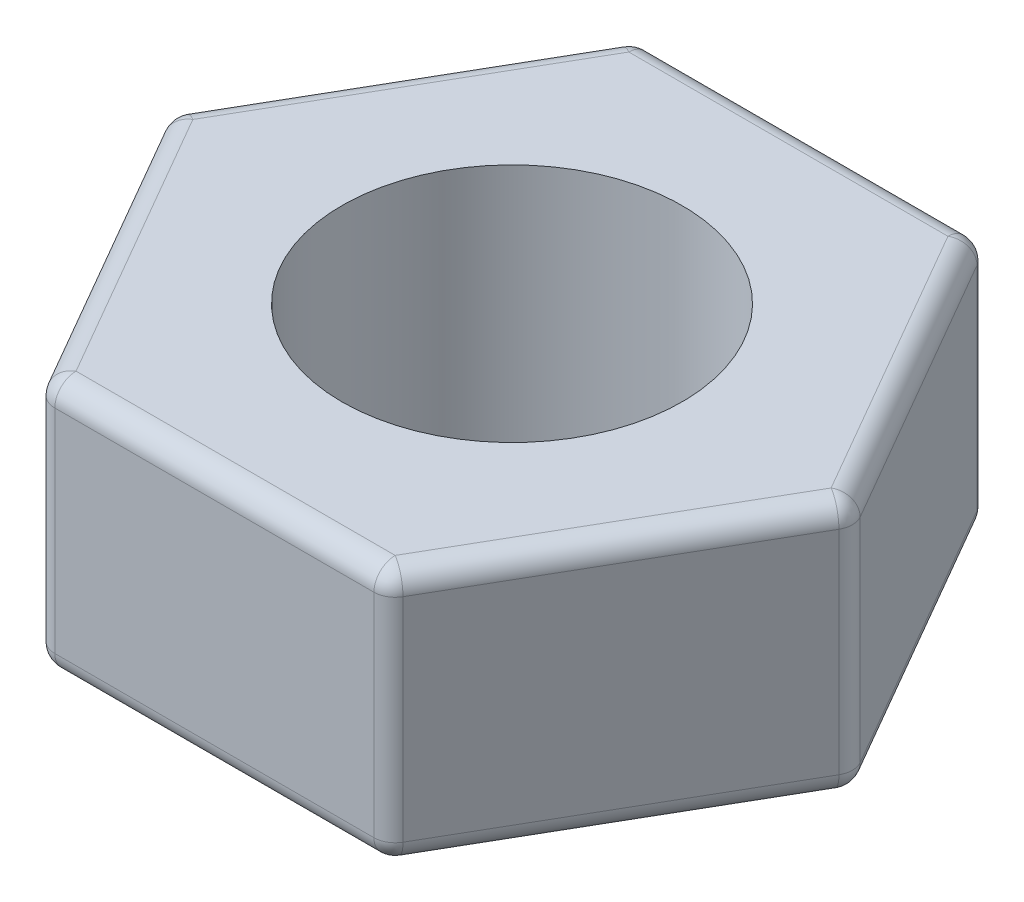
ISO-10303-21;
HEADER;
FILE_DESCRIPTION(('STEP AP214'),'2;1');
FILE_NAME('part.step','',(''),(''),'','','');
FILE_SCHEMA(('AUTOMOTIVE_DESIGN { 1 0 10303 214 1 1 1 1 }'));
ENDSEC;
DATA;
#1=APPLICATION_CONTEXT('core data for automotive mechanical design processes');
#2=APPLICATION_PROTOCOL_DEFINITION('international standard','automotive_design',2000,#1);
#3=PRODUCT_CONTEXT('',#1,'mechanical');
#4=PRODUCT('Part','Part','',(#3));
#5=PRODUCT_RELATED_PRODUCT_CATEGORY('part','',(#4));
#6=PRODUCT_DEFINITION_FORMATION('','',#4);
#7=PRODUCT_DEFINITION_CONTEXT('part definition',#1,'design');
#8=PRODUCT_DEFINITION('design','',#6,#7);
#9=PRODUCT_DEFINITION_SHAPE('','',#8);
#10=(LENGTH_UNIT() NAMED_UNIT(*) SI_UNIT(.MILLI.,.METRE.));
#11=(NAMED_UNIT(*) PLANE_ANGLE_UNIT() SI_UNIT($,.RADIAN.));
#12=(NAMED_UNIT(*) SI_UNIT($,.STERADIAN.) SOLID_ANGLE_UNIT());
#13=UNCERTAINTY_MEASURE_WITH_UNIT(LENGTH_MEASURE(1.E-05),#10,'distance_accuracy_value','');
#14=(GEOMETRIC_REPRESENTATION_CONTEXT(3) GLOBAL_UNCERTAINTY_ASSIGNED_CONTEXT((#13)) GLOBAL_UNIT_ASSIGNED_CONTEXT((#10,
#11,#12)) REPRESENTATION_CONTEXT('',''));
#15=CARTESIAN_POINT('',(0.,0.,0.));
#16=DIRECTION('',(0.,0.,1.));
#17=DIRECTION('',(1.,0.,0.));
#18=AXIS2_PLACEMENT_3D('',#15,#16,#17);
#19=CARTESIAN_POINT('',(0.,3.,0.));
#20=DIRECTION('',(0.,1.,0.));
#21=DIRECTION('',(0.,0.,1.));
#22=AXIS2_PLACEMENT_3D('',#19,#20,#21);
#23=PLANE('',#22);
#24=DIRECTION('',(-0.5,0.,-0.866025403784439));
#25=VECTOR('',#24,1.);
#26=CARTESIAN_POINT('',(1.80421959121758,3.,-3.375));
#27=LINE('',#26,#25);
#28=CARTESIAN_POINT('',(3.75277674973257,3.,0.));
#29=VERTEX_POINT('',#28);
#30=CARTESIAN_POINT('',(1.87638837486629,3.,-3.25));
#31=VERTEX_POINT('',#30);
#32=EDGE_CURVE('E388',#29,#31,#27,.T.);
#33=ORIENTED_EDGE('',*,*,#32,.T.);
#34=DIRECTION('',(-1.,0.,0.));
#35=VECTOR('',#34,1.);
#36=CARTESIAN_POINT('',(-2.02072594216369,3.,-3.25));
#37=LINE('',#36,#35);
#38=CARTESIAN_POINT('',(-1.87638837486628,3.,-3.25));
#39=VERTEX_POINT('',#38);
#40=EDGE_CURVE('E391',#31,#39,#37,.T.);
#41=ORIENTED_EDGE('',*,*,#40,.T.);
#42=DIRECTION('',(-0.5,0.,0.866025403784439));
#43=VECTOR('',#42,1.);
#44=CARTESIAN_POINT('',(-3.82494553338127,3.,0.125));
#45=LINE('',#44,#43);
#46=CARTESIAN_POINT('',(-3.75277674973257,3.,0.));
#47=VERTEX_POINT('',#46);
#48=EDGE_CURVE('E385',#39,#47,#45,.T.);
#49=ORIENTED_EDGE('',*,*,#48,.T.);
#50=DIRECTION('',(0.5,0.,0.866025403784439));
#51=VECTOR('',#50,1.);
#52=CARTESIAN_POINT('',(-1.80421959121758,3.,3.375));
#53=LINE('',#52,#51);
#54=CARTESIAN_POINT('',(-1.87638837486629,3.,3.25));
#55=VERTEX_POINT('',#54);
#56=EDGE_CURVE('E379',#47,#55,#53,.T.);
#57=ORIENTED_EDGE('',*,*,#56,.T.);
#58=DIRECTION('',(1.,0.,0.));
#59=VECTOR('',#58,1.);
#60=CARTESIAN_POINT('',(2.02072594216369,3.,3.25));
#61=LINE('',#60,#59);
#62=CARTESIAN_POINT('',(1.87638837486628,3.,3.25));
#63=VERTEX_POINT('',#62);
#64=EDGE_CURVE('E376',#55,#63,#61,.T.);
#65=ORIENTED_EDGE('',*,*,#64,.T.);
#66=DIRECTION('',(0.5,0.,-0.866025403784439));
#67=VECTOR('',#66,1.);
#68=CARTESIAN_POINT('',(3.82494553338127,3.,-0.125000000000001));
#69=LINE('',#68,#67);
#70=EDGE_CURVE('E382',#63,#29,#69,.T.);
#71=ORIENTED_EDGE('',*,*,#70,.T.);
#72=EDGE_LOOP('',(#33,#41,#49,#57,#65,#71));
#73=FACE_BOUND('',#72,.T.);
#74=CARTESIAN_POINT('',(0.,3.,0.));
#75=DIRECTION('',(0.,1.,0.));
#76=DIRECTION('',(0.,0.,1.));
#77=AXIS2_PLACEMENT_3D('',#74,#75,#76);
#78=CIRCLE('',#77,2.);
#79=CARTESIAN_POINT('',(0.,3.,2.));
#80=VERTEX_POINT('',#79);
#81=EDGE_CURVE('E195',#80,#80,#78,.T.);
#82=ORIENTED_EDGE('',*,*,#81,.F.);
#83=EDGE_LOOP('',(#82));
#84=FACE_BOUND('',#83,.T.);
#85=ADVANCED_FACE('F43',(#73,#84),#23,.T.);
#86=CARTESIAN_POINT('',(0.,0.,0.));
#87=DIRECTION('',(0.,1.,0.));
#88=DIRECTION('',(0.,0.,1.));
#89=AXIS2_PLACEMENT_3D('',#86,#87,#88);
#90=PLANE('',#89);
#91=DIRECTION('',(-0.5,0.,0.866025403784439));
#92=VECTOR('',#91,1.);
#93=CARTESIAN_POINT('',(-2.81458256229943,0.,-1.625));
#94=LINE('',#93,#92);
#95=CARTESIAN_POINT('',(-3.75277674973257,0.,0.));
#96=VERTEX_POINT('',#95);
#97=CARTESIAN_POINT('',(-1.87638837486628,0.,-3.25));
#98=VERTEX_POINT('',#97);
#99=EDGE_CURVE('E341',#96,#98,#94,.F.);
#100=ORIENTED_EDGE('',*,*,#99,.T.);
#101=DIRECTION('',(-1.,0.,0.));
#102=VECTOR('',#101,1.);
#103=CARTESIAN_POINT('',(0.,0.,-3.25));
#104=LINE('',#103,#102);
#105=CARTESIAN_POINT('',(1.87638837486629,0.,-3.25));
#106=VERTEX_POINT('',#105);
#107=EDGE_CURVE('E347',#98,#106,#104,.F.);
#108=ORIENTED_EDGE('',*,*,#107,.T.);
#109=DIRECTION('',(-0.5,0.,-0.866025403784439));
#110=VECTOR('',#109,1.);
#111=CARTESIAN_POINT('',(2.81458256229943,0.,-1.625));
#112=LINE('',#111,#110);
#113=CARTESIAN_POINT('',(3.75277674973257,0.,0.));
#114=VERTEX_POINT('',#113);
#115=EDGE_CURVE('E344',#106,#114,#112,.F.);
#116=ORIENTED_EDGE('',*,*,#115,.T.);
#117=DIRECTION('',(0.5,0.,-0.866025403784439));
#118=VECTOR('',#117,1.);
#119=CARTESIAN_POINT('',(2.81458256229943,0.,1.625));
#120=LINE('',#119,#118);
#121=CARTESIAN_POINT('',(1.87638837486628,0.,3.25));
#122=VERTEX_POINT('',#121);
#123=EDGE_CURVE('E338',#114,#122,#120,.F.);
#124=ORIENTED_EDGE('',*,*,#123,.T.);
#125=DIRECTION('',(1.,0.,0.));
#126=VECTOR('',#125,1.);
#127=CARTESIAN_POINT('',(0.,0.,3.25));
#128=LINE('',#127,#126);
#129=CARTESIAN_POINT('',(-1.87638837486629,0.,3.25));
#130=VERTEX_POINT('',#129);
#131=EDGE_CURVE('E335',#122,#130,#128,.F.);
#132=ORIENTED_EDGE('',*,*,#131,.T.);
#133=DIRECTION('',(0.5,0.,0.866025403784439));
#134=VECTOR('',#133,1.);
#135=CARTESIAN_POINT('',(-2.81458256229943,0.,1.625));
#136=LINE('',#135,#134);
#137=EDGE_CURVE('E332',#130,#96,#136,.F.);
#138=ORIENTED_EDGE('',*,*,#137,.T.);
#139=EDGE_LOOP('',(#100,#108,#116,#124,#132,#138));
#140=FACE_BOUND('',#139,.T.);
#141=CARTESIAN_POINT('',(0.,0.,0.));
#142=DIRECTION('',(0.,1.,0.));
#143=DIRECTION('',(0.,0.,1.));
#144=AXIS2_PLACEMENT_3D('',#141,#142,#143);
#145=CIRCLE('',#144,2.);
#146=CARTESIAN_POINT('',(0.,0.,2.));
#147=VERTEX_POINT('',#146);
#148=EDGE_CURVE('E314',#147,#147,#145,.T.);
#149=ORIENTED_EDGE('',*,*,#148,.T.);
#150=EDGE_LOOP('',(#149));
#151=FACE_BOUND('',#150,.T.);
#152=ADVANCED_FACE('F461',(#140,#151),#90,.F.);
#153=CARTESIAN_POINT('',(2.02072594216369,3.,-3.5));
#154=DIRECTION('',(0.,0.,1.));
#155=DIRECTION('',(1.,0.,0.));
#156=AXIS2_PLACEMENT_3D('',#153,#154,#155);
#157=PLANE('',#156);
#158=DIRECTION('',(0.,-1.,0.));
#159=VECTOR('',#158,1.);
#160=CARTESIAN_POINT('',(1.87638837486629,3.,-3.5));
#161=LINE('',#160,#159);
#162=CARTESIAN_POINT('',(1.87638837486629,2.75,-3.5));
#163=VERTEX_POINT('',#162);
#164=CARTESIAN_POINT('',(1.87638837486629,0.25,-3.5));
#165=VERTEX_POINT('',#164);
#166=EDGE_CURVE('E182',#163,#165,#161,.T.);
#167=ORIENTED_EDGE('',*,*,#166,.T.);
#168=DIRECTION('',(-1.,0.,0.));
#169=VECTOR('',#168,1.);
#170=CARTESIAN_POINT('',(2.02072594216369,0.25,-3.5));
#171=LINE('',#170,#169);
#172=CARTESIAN_POINT('',(-1.87638837486628,0.25,-3.5));
#173=VERTEX_POINT('',#172);
#174=EDGE_CURVE('E177',#165,#173,#171,.T.);
#175=ORIENTED_EDGE('',*,*,#174,.T.);
#176=DIRECTION('',(0.,-1.,0.));
#177=VECTOR('',#176,1.);
#178=CARTESIAN_POINT('',(-1.87638837486628,3.,-3.5));
#179=LINE('',#178,#177);
#180=CARTESIAN_POINT('',(-1.87638837486628,2.75,-3.5));
#181=VERTEX_POINT('',#180);
#182=EDGE_CURVE('E171',#173,#181,#179,.F.);
#183=ORIENTED_EDGE('',*,*,#182,.T.);
#184=DIRECTION('',(-1.,0.,0.));
#185=VECTOR('',#184,1.);
#186=CARTESIAN_POINT('',(2.02072594216369,2.75,-3.5));
#187=LINE('',#186,#185);
#188=EDGE_CURVE('E174',#181,#163,#187,.F.);
#189=ORIENTED_EDGE('',*,*,#188,.T.);
#190=EDGE_LOOP('',(#167,#175,#183,#189));
#191=FACE_BOUND('',#190,.T.);
#192=ADVANCED_FACE('F173',(#191),#157,.F.);
#193=CARTESIAN_POINT('',(-2.02072594216369,3.,-3.5));
#194=DIRECTION('',(0.866025403784439,0.,0.5));
#195=DIRECTION('',(0.5,0.,-0.866025403784439));
#196=AXIS2_PLACEMENT_3D('',#193,#194,#195);
#197=PLANE('',#196);
#198=DIRECTION('',(0.,-1.,0.));
#199=VECTOR('',#198,1.);
#200=CARTESIAN_POINT('',(-2.09289472581239,3.,-3.375));
#201=LINE('',#200,#199);
#202=CARTESIAN_POINT('',(-2.09289472581239,2.75,-3.375));
#203=VERTEX_POINT('',#202);
#204=CARTESIAN_POINT('',(-2.09289472581239,0.25,-3.375));
#205=VERTEX_POINT('',#204);
#206=EDGE_CURVE('E207',#203,#205,#201,.T.);
#207=ORIENTED_EDGE('',*,*,#206,.T.);
#208=DIRECTION('',(-0.5,0.,0.866025403784439));
#209=VECTOR('',#208,1.);
#210=CARTESIAN_POINT('',(-2.02072594216369,0.25,-3.5));
#211=LINE('',#210,#209);
#212=CARTESIAN_POINT('',(-3.96928310067868,0.25,-0.125000000000001));
#213=VERTEX_POINT('',#212);
#214=EDGE_CURVE('E372',#205,#213,#211,.T.);
#215=ORIENTED_EDGE('',*,*,#214,.T.);
#216=DIRECTION('',(0.,-1.,0.));
#217=VECTOR('',#216,1.);
#218=CARTESIAN_POINT('',(-3.96928310067868,3.,-0.125000000000001));
#219=LINE('',#218,#217);
#220=CARTESIAN_POINT('',(-3.96928310067868,2.75,-0.125000000000001));
#221=VERTEX_POINT('',#220);
#222=EDGE_CURVE('E367',#213,#221,#219,.F.);
#223=ORIENTED_EDGE('',*,*,#222,.T.);
#224=DIRECTION('',(-0.5,0.,0.866025403784439));
#225=VECTOR('',#224,1.);
#226=CARTESIAN_POINT('',(-2.02072594216369,2.75,-3.5));
#227=LINE('',#226,#225);
#228=EDGE_CURVE('E364',#221,#203,#227,.F.);
#229=ORIENTED_EDGE('',*,*,#228,.T.);
#230=EDGE_LOOP('',(#207,#215,#223,#229));
#231=FACE_BOUND('',#230,.T.);
#232=ADVANCED_FACE('F474',(#231),#197,.F.);
#233=CARTESIAN_POINT('',(-4.04145188432738,3.,0.));
#234=DIRECTION('',(0.866025403784439,0.,-0.5));
#235=DIRECTION('',(-0.5,0.,-0.866025403784439));
#236=AXIS2_PLACEMENT_3D('',#233,#234,#235);
#237=PLANE('',#236);
#238=DIRECTION('',(0.,-1.,0.));
#239=VECTOR('',#238,1.);
#240=CARTESIAN_POINT('',(-3.96928310067868,3.,0.124999999999999));
#241=LINE('',#240,#239);
#242=CARTESIAN_POINT('',(-3.96928310067868,2.75,0.124999999999999));
#243=VERTEX_POINT('',#242);
#244=CARTESIAN_POINT('',(-3.96928310067868,0.25,0.124999999999999));
#245=VERTEX_POINT('',#244);
#246=EDGE_CURVE('E53',#243,#245,#241,.T.);
#247=ORIENTED_EDGE('',*,*,#246,.T.);
#248=DIRECTION('',(0.5,0.,0.866025403784439));
#249=VECTOR('',#248,1.);
#250=CARTESIAN_POINT('',(-4.04145188432738,0.25,0.));
#251=LINE('',#250,#249);
#252=CARTESIAN_POINT('',(-2.0928947258124,0.25,3.375));
#253=VERTEX_POINT('',#252);
#254=EDGE_CURVE('E11',#245,#253,#251,.T.);
#255=ORIENTED_EDGE('',*,*,#254,.T.);
#256=DIRECTION('',(0.,-1.,0.));
#257=VECTOR('',#256,1.);
#258=CARTESIAN_POINT('',(-2.0928947258124,3.,3.375));
#259=LINE('',#258,#257);
#260=CARTESIAN_POINT('',(-2.0928947258124,2.75,3.375));
#261=VERTEX_POINT('',#260);
#262=EDGE_CURVE('E424',#253,#261,#259,.F.);
#263=ORIENTED_EDGE('',*,*,#262,.T.);
#264=DIRECTION('',(0.5,0.,0.866025403784439));
#265=VECTOR('',#264,1.);
#266=CARTESIAN_POINT('',(-4.04145188432738,2.75,0.));
#267=LINE('',#266,#265);
#268=EDGE_CURVE('E421',#261,#243,#267,.F.);
#269=ORIENTED_EDGE('',*,*,#268,.T.);
#270=EDGE_LOOP('',(#247,#255,#263,#269));
#271=FACE_BOUND('',#270,.T.);
#272=ADVANCED_FACE('F582',(#271),#237,.F.);
#273=CARTESIAN_POINT('',(-2.02072594216369,3.,3.5));
#274=DIRECTION('',(0.,0.,-1.));
#275=DIRECTION('',(-1.,0.,0.));
#276=AXIS2_PLACEMENT_3D('',#273,#274,#275);
#277=PLANE('',#276);
#278=DIRECTION('',(0.,-1.,0.));
#279=VECTOR('',#278,1.);
#280=CARTESIAN_POINT('',(-1.87638837486629,3.,3.5));
#281=LINE('',#280,#279);
#282=CARTESIAN_POINT('',(-1.87638837486629,2.75,3.5));
#283=VERTEX_POINT('',#282);
#284=CARTESIAN_POINT('',(-1.87638837486629,0.25,3.5));
#285=VERTEX_POINT('',#284);
#286=EDGE_CURVE('E411',#283,#285,#281,.T.);
#287=ORIENTED_EDGE('',*,*,#286,.T.);
#288=DIRECTION('',(1.,0.,0.));
#289=VECTOR('',#288,1.);
#290=CARTESIAN_POINT('',(-2.02072594216369,0.25,3.5));
#291=LINE('',#290,#289);
#292=CARTESIAN_POINT('',(1.87638837486628,0.25,3.5));
#293=VERTEX_POINT('',#292);
#294=EDGE_CURVE('E417',#285,#293,#291,.T.);
#295=ORIENTED_EDGE('',*,*,#294,.T.);
#296=DIRECTION('',(0.,-1.,0.));
#297=VECTOR('',#296,1.);
#298=CARTESIAN_POINT('',(1.87638837486628,3.,3.5));
#299=LINE('',#298,#297);
#300=CARTESIAN_POINT('',(1.87638837486628,2.75,3.5));
#301=VERTEX_POINT('',#300);
#302=EDGE_CURVE('E414',#293,#301,#299,.F.);
#303=ORIENTED_EDGE('',*,*,#302,.T.);
#304=DIRECTION('',(1.,0.,0.));
#305=VECTOR('',#304,1.);
#306=CARTESIAN_POINT('',(-2.02072594216369,2.75,3.5));
#307=LINE('',#306,#305);
#308=EDGE_CURVE('E408',#301,#283,#307,.F.);
#309=ORIENTED_EDGE('',*,*,#308,.T.);
#310=EDGE_LOOP('',(#287,#295,#303,#309));
#311=FACE_BOUND('',#310,.T.);
#312=ADVANCED_FACE('F523',(#311),#277,.F.);
#313=CARTESIAN_POINT('',(2.02072594216369,3.,3.5));
#314=DIRECTION('',(-0.866025403784439,0.,-0.5));
#315=DIRECTION('',(-0.5,0.,0.866025403784439));
#316=AXIS2_PLACEMENT_3D('',#313,#314,#315);
#317=PLANE('',#316);
#318=DIRECTION('',(0.5,0.,-0.866025403784439));
#319=VECTOR('',#318,1.);
#320=CARTESIAN_POINT('',(2.02072594216369,0.25,3.5));
#321=LINE('',#320,#319);
#322=CARTESIAN_POINT('',(2.09289472581239,0.25,3.375));
#323=VERTEX_POINT('',#322);
#324=CARTESIAN_POINT('',(3.96928310067868,0.25,0.124999999999999));
#325=VERTEX_POINT('',#324);
#326=EDGE_CURVE('E401',#323,#325,#321,.T.);
#327=ORIENTED_EDGE('',*,*,#326,.T.);
#328=DIRECTION('',(0.,-1.,0.));
#329=VECTOR('',#328,1.);
#330=CARTESIAN_POINT('',(3.96928310067868,3.,0.124999999999999));
#331=LINE('',#330,#329);
#332=CARTESIAN_POINT('',(3.96928310067868,2.75,0.124999999999999));
#333=VERTEX_POINT('',#332);
#334=EDGE_CURVE('E404',#325,#333,#331,.F.);
#335=ORIENTED_EDGE('',*,*,#334,.T.);
#336=DIRECTION('',(0.5,0.,-0.866025403784439));
#337=VECTOR('',#336,1.);
#338=CARTESIAN_POINT('',(2.02072594216369,2.75,3.5));
#339=LINE('',#338,#337);
#340=CARTESIAN_POINT('',(2.09289472581239,2.75,3.375));
#341=VERTEX_POINT('',#340);
#342=EDGE_CURVE('E398',#333,#341,#339,.F.);
#343=ORIENTED_EDGE('',*,*,#342,.T.);
#344=DIRECTION('',(0.,-1.,0.));
#345=VECTOR('',#344,1.);
#346=CARTESIAN_POINT('',(2.09289472581239,3.,3.375));
#347=LINE('',#346,#345);
#348=EDGE_CURVE('E395',#341,#323,#347,.T.);
#349=ORIENTED_EDGE('',*,*,#348,.T.);
#350=EDGE_LOOP('',(#327,#335,#343,#349));
#351=FACE_BOUND('',#350,.T.);
#352=ADVANCED_FACE('F576',(#351),#317,.F.);
#353=CARTESIAN_POINT('',(4.04145188432738,3.,0.));
#354=DIRECTION('',(-0.866025403784439,0.,0.5));
#355=DIRECTION('',(0.5,0.,0.866025403784439));
#356=AXIS2_PLACEMENT_3D('',#353,#354,#355);
#357=PLANE('',#356);
#358=DIRECTION('',(-0.5,0.,-0.866025403784439));
#359=VECTOR('',#358,1.);
#360=CARTESIAN_POINT('',(4.04145188432738,0.25,0.));
#361=LINE('',#360,#359);
#362=CARTESIAN_POINT('',(3.96928310067868,0.25,-0.125000000000001));
#363=VERTEX_POINT('',#362);
#364=CARTESIAN_POINT('',(2.0928947258124,0.25,-3.375));
#365=VERTEX_POINT('',#364);
#366=EDGE_CURVE('E357',#363,#365,#361,.T.);
#367=ORIENTED_EDGE('',*,*,#366,.T.);
#368=DIRECTION('',(0.,-1.,0.));
#369=VECTOR('',#368,1.);
#370=CARTESIAN_POINT('',(2.0928947258124,3.,-3.375));
#371=LINE('',#370,#369);
#372=CARTESIAN_POINT('',(2.0928947258124,2.75,-3.375));
#373=VERTEX_POINT('',#372);
#374=EDGE_CURVE('E360',#365,#373,#371,.F.);
#375=ORIENTED_EDGE('',*,*,#374,.T.);
#376=DIRECTION('',(-0.5,0.,-0.866025403784439));
#377=VECTOR('',#376,1.);
#378=CARTESIAN_POINT('',(4.04145188432738,2.75,0.));
#379=LINE('',#378,#377);
#380=CARTESIAN_POINT('',(3.96928310067868,2.75,-0.125000000000001));
#381=VERTEX_POINT('',#380);
#382=EDGE_CURVE('E354',#373,#381,#379,.F.);
#383=ORIENTED_EDGE('',*,*,#382,.T.);
#384=DIRECTION('',(0.,-1.,0.));
#385=VECTOR('',#384,1.);
#386=CARTESIAN_POINT('',(3.96928310067868,3.,-0.125000000000001));
#387=LINE('',#386,#385);
#388=EDGE_CURVE('E351',#381,#363,#387,.T.);
#389=ORIENTED_EDGE('',*,*,#388,.T.);
#390=EDGE_LOOP('',(#367,#375,#383,#389));
#391=FACE_BOUND('',#390,.T.);
#392=ADVANCED_FACE('F495',(#391),#357,.F.);
#393=CARTESIAN_POINT('',(0.,3.,0.));
#394=DIRECTION('',(0.,-1.,0.));
#395=DIRECTION('',(0.,0.,-1.));
#396=AXIS2_PLACEMENT_3D('',#393,#394,#395);
#397=CYLINDRICAL_SURFACE('',#396,2.);
#398=ORIENTED_EDGE('',*,*,#81,.T.);
#399=EDGE_LOOP('',(#398));
#400=FACE_BOUND('',#399,.T.);
#401=ORIENTED_EDGE('',*,*,#148,.F.);
#402=EDGE_LOOP('',(#401));
#403=FACE_BOUND('',#402,.T.);
#404=ADVANCED_FACE('F572',(#400,#403),#397,.F.);
#405=CARTESIAN_POINT('',(0.,2.75,3.25));
#406=DIRECTION('',(-1.,0.,0.));
#407=DIRECTION('',(0.,0.,1.));
#408=AXIS2_PLACEMENT_3D('',#405,#406,#407);
#409=CYLINDRICAL_SURFACE('',#408,0.25);
#410=CARTESIAN_POINT('',(1.87638837486628,2.75,3.25));
#411=DIRECTION('',(1.,0.,0.));
#412=DIRECTION('',(0.,0.,-1.));
#413=AXIS2_PLACEMENT_3D('',#410,#411,#412);
#414=CIRCLE('',#413,0.25);
#415=EDGE_CURVE('E47',#63,#301,#414,.T.);
#416=ORIENTED_EDGE('',*,*,#415,.F.);
#417=ORIENTED_EDGE('',*,*,#64,.F.);
#418=CARTESIAN_POINT('',(-1.87638837486629,2.75,3.25));
#419=DIRECTION('',(-1.,0.,0.));
#420=DIRECTION('',(0.,-1.,0.));
#421=AXIS2_PLACEMENT_3D('',#418,#419,#420);
#422=CIRCLE('',#421,0.25);
#423=EDGE_CURVE('E305',#283,#55,#422,.T.);
#424=ORIENTED_EDGE('',*,*,#423,.F.);
#425=ORIENTED_EDGE('',*,*,#308,.F.);
#426=EDGE_LOOP('',(#416,#417,#424,#425));
#427=FACE_BOUND('',#426,.T.);
#428=ADVANCED_FACE('F45',(#427),#409,.T.);
#429=CARTESIAN_POINT('',(1.87638837486628,2.75,3.25));
#430=DIRECTION('',(0.,1.,0.));
#431=DIRECTION('',(0.,0.,1.));
#432=AXIS2_PLACEMENT_3D('',#429,#430,#431);
#433=SPHERICAL_SURFACE('',#432,0.25);
#434=CARTESIAN_POINT('',(1.87638837486628,2.75,3.25));
#435=DIRECTION('',(-0.500000000000001,0.,0.866025403784438));
#436=DIRECTION('',(0.866025403784438,0.,0.500000000000001));
#437=AXIS2_PLACEMENT_3D('',#434,#435,#436);
#438=CIRCLE('',#437,0.25);
#439=EDGE_CURVE('E298',#63,#341,#438,.F.);
#440=ORIENTED_EDGE('',*,*,#439,.F.);
#441=ORIENTED_EDGE('',*,*,#415,.T.);
#442=CARTESIAN_POINT('',(1.87638837486628,2.75,3.25));
#443=DIRECTION('',(0.,1.,0.));
#444=DIRECTION('',(0.,0.,1.));
#445=AXIS2_PLACEMENT_3D('',#442,#443,#444);
#446=CIRCLE('',#445,0.25);
#447=EDGE_CURVE('E302',#341,#301,#446,.F.);
#448=ORIENTED_EDGE('',*,*,#447,.F.);
#449=EDGE_LOOP('',(#440,#441,#448));
#450=FACE_BOUND('',#449,.T.);
#451=ADVANCED_FACE('F548',(#450),#433,.T.);
#452=CARTESIAN_POINT('',(-1.87638837486629,2.75,3.25));
#453=DIRECTION('',(0.,1.,0.));
#454=DIRECTION('',(-1.,0.,0.));
#455=AXIS2_PLACEMENT_3D('',#452,#453,#454);
#456=SPHERICAL_SURFACE('',#455,0.25);
#457=CARTESIAN_POINT('',(-1.87638837486629,2.75,3.25));
#458=DIRECTION('',(0.,1.,0.));
#459=DIRECTION('',(0.,0.,1.));
#460=AXIS2_PLACEMENT_3D('',#457,#458,#459);
#461=CIRCLE('',#460,0.25);
#462=EDGE_CURVE('E290',#283,#261,#461,.F.);
#463=ORIENTED_EDGE('',*,*,#462,.F.);
#464=ORIENTED_EDGE('',*,*,#423,.T.);
#465=CARTESIAN_POINT('',(-1.87638837486629,2.75,3.25));
#466=DIRECTION('',(0.5,0.,0.866025403784439));
#467=DIRECTION('',(0.866025403784439,0.,-0.5));
#468=AXIS2_PLACEMENT_3D('',#465,#466,#467);
#469=CIRCLE('',#468,0.25);
#470=EDGE_CURVE('E294',#261,#55,#469,.F.);
#471=ORIENTED_EDGE('',*,*,#470,.F.);
#472=EDGE_LOOP('',(#463,#464,#471));
#473=FACE_BOUND('',#472,.T.);
#474=ADVANCED_FACE('F842',(#473),#456,.T.);
#475=CARTESIAN_POINT('',(1.87638837486628,3.,3.25));
#476=DIRECTION('',(0.,-1.,0.));
#477=DIRECTION('',(0.,0.,-1.));
#478=AXIS2_PLACEMENT_3D('',#475,#476,#477);
#479=CYLINDRICAL_SURFACE('',#478,0.25);
#480=ORIENTED_EDGE('',*,*,#447,.T.);
#481=ORIENTED_EDGE('',*,*,#302,.F.);
#482=CARTESIAN_POINT('',(1.87638837486628,0.25,3.25));
#483=DIRECTION('',(0.,-1.,0.));
#484=DIRECTION('',(0.,0.,-1.));
#485=AXIS2_PLACEMENT_3D('',#482,#483,#484);
#486=CIRCLE('',#485,0.25);
#487=EDGE_CURVE('E283',#323,#293,#486,.T.);
#488=ORIENTED_EDGE('',*,*,#487,.F.);
#489=ORIENTED_EDGE('',*,*,#348,.F.);
#490=EDGE_LOOP('',(#480,#481,#488,#489));
#491=FACE_BOUND('',#490,.T.);
#492=ADVANCED_FACE('F520',(#491),#479,.T.);
#493=CARTESIAN_POINT('',(2.81458256229943,2.75,1.625));
#494=DIRECTION('',(-0.5,0.,0.866025403784439));
#495=DIRECTION('',(0.866025403784439,0.,0.5));
#496=AXIS2_PLACEMENT_3D('',#493,#494,#495);
#497=CYLINDRICAL_SURFACE('',#496,0.25);
#498=ORIENTED_EDGE('',*,*,#439,.T.);
#499=ORIENTED_EDGE('',*,*,#342,.F.);
#500=CARTESIAN_POINT('',(3.75277674973257,2.75,0.));
#501=DIRECTION('',(0.5,0.,-0.866025403784439));
#502=DIRECTION('',(-0.866025403784439,0.,-0.5));
#503=AXIS2_PLACEMENT_3D('',#500,#501,#502);
#504=CIRCLE('',#503,0.25);
#505=EDGE_CURVE('E279',#29,#333,#504,.T.);
#506=ORIENTED_EDGE('',*,*,#505,.F.);
#507=ORIENTED_EDGE('',*,*,#70,.F.);
#508=EDGE_LOOP('',(#498,#499,#506,#507));
#509=FACE_BOUND('',#508,.T.);
#510=ADVANCED_FACE('F552',(#509),#497,.T.);
#511=CARTESIAN_POINT('',(-2.81458256229943,2.75,1.625));
#512=DIRECTION('',(-0.5,0.,-0.866025403784439));
#513=DIRECTION('',(-0.866025403784439,0.,0.5));
#514=AXIS2_PLACEMENT_3D('',#511,#512,#513);
#515=CYLINDRICAL_SURFACE('',#514,0.25);
#516=ORIENTED_EDGE('',*,*,#470,.T.);
#517=ORIENTED_EDGE('',*,*,#56,.F.);
#518=CARTESIAN_POINT('',(-3.75277674973257,2.75,0.));
#519=DIRECTION('',(-0.499999999999999,0.,-0.866025403784439));
#520=DIRECTION('',(-0.866025403784439,0.,0.499999999999999));
#521=AXIS2_PLACEMENT_3D('',#518,#519,#520);
#522=CIRCLE('',#521,0.25);
#523=EDGE_CURVE('E275',#243,#47,#522,.T.);
#524=ORIENTED_EDGE('',*,*,#523,.F.);
#525=ORIENTED_EDGE('',*,*,#268,.F.);
#526=EDGE_LOOP('',(#516,#517,#524,#525));
#527=FACE_BOUND('',#526,.T.);
#528=ADVANCED_FACE('F544',(#527),#515,.T.);
#529=CARTESIAN_POINT('',(-1.87638837486629,3.,3.25));
#530=DIRECTION('',(0.,-1.,0.));
#531=DIRECTION('',(0.,0.,-1.));
#532=AXIS2_PLACEMENT_3D('',#529,#530,#531);
#533=CYLINDRICAL_SURFACE('',#532,0.25);
#534=ORIENTED_EDGE('',*,*,#462,.T.);
#535=ORIENTED_EDGE('',*,*,#262,.F.);
#536=CARTESIAN_POINT('',(-1.87638837486629,0.25,3.25));
#537=DIRECTION('',(0.,-1.,0.));
#538=DIRECTION('',(0.,0.,-1.));
#539=AXIS2_PLACEMENT_3D('',#536,#537,#538);
#540=CIRCLE('',#539,0.25);
#541=EDGE_CURVE('E272',#285,#253,#540,.T.);
#542=ORIENTED_EDGE('',*,*,#541,.F.);
#543=ORIENTED_EDGE('',*,*,#286,.F.);
#544=EDGE_LOOP('',(#534,#535,#542,#543));
#545=FACE_BOUND('',#544,.T.);
#546=ADVANCED_FACE('F528',(#545),#533,.T.);
#547=CARTESIAN_POINT('',(-2.02072594216369,0.25,3.25));
#548=DIRECTION('',(1.,0.,0.));
#549=DIRECTION('',(0.,0.,-1.));
#550=AXIS2_PLACEMENT_3D('',#547,#548,#549);
#551=CYLINDRICAL_SURFACE('',#550,0.25);
#552=CARTESIAN_POINT('',(1.87638837486628,0.25,3.25));
#553=DIRECTION('',(1.,0.,0.));
#554=DIRECTION('',(0.,0.,-1.));
#555=AXIS2_PLACEMENT_3D('',#552,#553,#554);
#556=CIRCLE('',#555,0.25);
#557=EDGE_CURVE('E286',#293,#122,#556,.T.);
#558=ORIENTED_EDGE('',*,*,#557,.F.);
#559=ORIENTED_EDGE('',*,*,#294,.F.);
#560=CARTESIAN_POINT('',(-1.87638837486629,0.25,3.25));
#561=DIRECTION('',(-1.,0.,0.));
#562=DIRECTION('',(0.,0.,1.));
#563=AXIS2_PLACEMENT_3D('',#560,#561,#562);
#564=CIRCLE('',#563,0.25);
#565=EDGE_CURVE('E268',#130,#285,#564,.T.);
#566=ORIENTED_EDGE('',*,*,#565,.F.);
#567=ORIENTED_EDGE('',*,*,#131,.F.);
#568=EDGE_LOOP('',(#558,#559,#566,#567));
#569=FACE_BOUND('',#568,.T.);
#570=ADVANCED_FACE('F512',(#569),#551,.T.);
#571=CARTESIAN_POINT('',(1.87638837486628,0.25,3.25));
#572=DIRECTION('',(0.,-1.,0.));
#573=DIRECTION('',(0.,0.,-1.));
#574=AXIS2_PLACEMENT_3D('',#571,#572,#573);
#575=SPHERICAL_SURFACE('',#574,0.25);
#576=ORIENTED_EDGE('',*,*,#487,.T.);
#577=ORIENTED_EDGE('',*,*,#557,.T.);
#578=CARTESIAN_POINT('',(1.87638837486628,0.25,3.25));
#579=DIRECTION('',(-0.5,0.,0.866025403784438));
#580=DIRECTION('',(0.866025403784438,0.,0.5));
#581=AXIS2_PLACEMENT_3D('',#578,#579,#580);
#582=CIRCLE('',#581,0.25);
#583=EDGE_CURVE('E264',#323,#122,#582,.F.);
#584=ORIENTED_EDGE('',*,*,#583,.F.);
#585=EDGE_LOOP('',(#576,#577,#584));
#586=FACE_BOUND('',#585,.T.);
#587=ADVANCED_FACE('F516',(#586),#575,.T.);
#588=CARTESIAN_POINT('',(3.75277674973257,2.75,0.));
#589=DIRECTION('',(0.,1.,0.));
#590=DIRECTION('',(0.,0.,1.));
#591=AXIS2_PLACEMENT_3D('',#588,#589,#590);
#592=SPHERICAL_SURFACE('',#591,0.25);
#593=CARTESIAN_POINT('',(3.75277674973257,2.75,0.));
#594=DIRECTION('',(0.499999999999999,0.,0.866025403784439));
#595=DIRECTION('',(0.866025403784439,0.,-0.5));
#596=AXIS2_PLACEMENT_3D('',#593,#594,#595);
#597=CIRCLE('',#596,0.25);
#598=EDGE_CURVE('E257',#29,#381,#597,.F.);
#599=ORIENTED_EDGE('',*,*,#598,.F.);
#600=ORIENTED_EDGE('',*,*,#505,.T.);
#601=CARTESIAN_POINT('',(3.75277674973257,2.75,0.));
#602=DIRECTION('',(0.,1.,0.));
#603=DIRECTION('',(0.,0.,1.));
#604=AXIS2_PLACEMENT_3D('',#601,#602,#603);
#605=CIRCLE('',#604,0.25);
#606=EDGE_CURVE('E261',#381,#333,#605,.F.);
#607=ORIENTED_EDGE('',*,*,#606,.F.);
#608=EDGE_LOOP('',(#599,#600,#607));
#609=FACE_BOUND('',#608,.T.);
#610=ADVANCED_FACE('F556',(#609),#592,.T.);
#611=CARTESIAN_POINT('',(-3.75277674973257,2.75,0.));
#612=DIRECTION('',(0.,1.,0.));
#613=DIRECTION('',(-1.,0.,0.));
#614=AXIS2_PLACEMENT_3D('',#611,#612,#613);
#615=SPHERICAL_SURFACE('',#614,0.25);
#616=CARTESIAN_POINT('',(-3.75277674973257,2.75,0.));
#617=DIRECTION('',(0.,1.,0.));
#618=DIRECTION('',(0.,0.,1.));
#619=AXIS2_PLACEMENT_3D('',#616,#617,#618);
#620=CIRCLE('',#619,0.25);
#621=EDGE_CURVE('E249',#243,#221,#620,.F.);
#622=ORIENTED_EDGE('',*,*,#621,.F.);
#623=ORIENTED_EDGE('',*,*,#523,.T.);
#624=CARTESIAN_POINT('',(-3.75277674973257,2.75,0.));
#625=DIRECTION('',(-0.500000000000001,0.,0.866025403784438));
#626=DIRECTION('',(0.866025403784438,0.,0.500000000000001));
#627=AXIS2_PLACEMENT_3D('',#624,#625,#626);
#628=CIRCLE('',#627,0.25);
#629=EDGE_CURVE('E253',#221,#47,#628,.F.);
#630=ORIENTED_EDGE('',*,*,#629,.F.);
#631=EDGE_LOOP('',(#622,#623,#630));
#632=FACE_BOUND('',#631,.T.);
#633=ADVANCED_FACE('F540',(#632),#615,.T.);
#634=CARTESIAN_POINT('',(-1.87638837486629,0.25,3.25));
#635=DIRECTION('',(0.,-1.,0.));
#636=DIRECTION('',(0.,0.,-1.));
#637=AXIS2_PLACEMENT_3D('',#634,#635,#636);
#638=SPHERICAL_SURFACE('',#637,0.25);
#639=ORIENTED_EDGE('',*,*,#565,.T.);
#640=ORIENTED_EDGE('',*,*,#541,.T.);
#641=CARTESIAN_POINT('',(-1.87638837486629,0.25,3.25));
#642=DIRECTION('',(0.5,0.,0.866025403784439));
#643=DIRECTION('',(0.866025403784439,0.,-0.5));
#644=AXIS2_PLACEMENT_3D('',#641,#642,#643);
#645=CIRCLE('',#644,0.25);
#646=EDGE_CURVE('E66',#130,#253,#645,.F.);
#647=ORIENTED_EDGE('',*,*,#646,.F.);
#648=EDGE_LOOP('',(#639,#640,#647));
#649=FACE_BOUND('',#648,.T.);
#650=ADVANCED_FACE('F530',(#649),#638,.T.);
#651=CARTESIAN_POINT('',(1.80421959121758,0.25,3.375));
#652=DIRECTION('',(0.5,0.,-0.866025403784439));
#653=DIRECTION('',(-0.866025403784439,0.,-0.5));
#654=AXIS2_PLACEMENT_3D('',#651,#652,#653);
#655=CYLINDRICAL_SURFACE('',#654,0.25);
#656=ORIENTED_EDGE('',*,*,#583,.T.);
#657=ORIENTED_EDGE('',*,*,#123,.F.);
#658=CARTESIAN_POINT('',(3.75277674973257,0.25,0.));
#659=DIRECTION('',(0.5,0.,-0.866025403784439));
#660=DIRECTION('',(-0.866025403784439,0.,-0.5));
#661=AXIS2_PLACEMENT_3D('',#658,#659,#660);
#662=CIRCLE('',#661,0.25);
#663=EDGE_CURVE('E243',#325,#114,#662,.T.);
#664=ORIENTED_EDGE('',*,*,#663,.F.);
#665=ORIENTED_EDGE('',*,*,#326,.F.);
#666=EDGE_LOOP('',(#656,#657,#664,#665));
#667=FACE_BOUND('',#666,.T.);
#668=ADVANCED_FACE('F506',(#667),#655,.T.);
#669=CARTESIAN_POINT('',(3.75277674973257,3.,0.));
#670=DIRECTION('',(0.,-1.,0.));
#671=DIRECTION('',(0.,0.,-1.));
#672=AXIS2_PLACEMENT_3D('',#669,#670,#671);
#673=CYLINDRICAL_SURFACE('',#672,0.25);
#674=ORIENTED_EDGE('',*,*,#606,.T.);
#675=ORIENTED_EDGE('',*,*,#334,.F.);
#676=CARTESIAN_POINT('',(3.75277674973257,0.25,0.));
#677=DIRECTION('',(0.,-1.,0.));
#678=DIRECTION('',(0.,0.,-1.));
#679=AXIS2_PLACEMENT_3D('',#676,#677,#678);
#680=CIRCLE('',#679,0.25);
#681=EDGE_CURVE('E239',#363,#325,#680,.T.);
#682=ORIENTED_EDGE('',*,*,#681,.F.);
#683=ORIENTED_EDGE('',*,*,#388,.F.);
#684=EDGE_LOOP('',(#674,#675,#682,#683));
#685=FACE_BOUND('',#684,.T.);
#686=ADVANCED_FACE('F500',(#685),#673,.T.);
#687=CARTESIAN_POINT('',(2.81458256229943,2.75,-1.625));
#688=DIRECTION('',(0.5,0.,0.866025403784439));
#689=DIRECTION('',(0.866025403784439,0.,-0.5));
#690=AXIS2_PLACEMENT_3D('',#687,#688,#689);
#691=CYLINDRICAL_SURFACE('',#690,0.25);
#692=ORIENTED_EDGE('',*,*,#598,.T.);
#693=ORIENTED_EDGE('',*,*,#382,.F.);
#694=CARTESIAN_POINT('',(1.87638837486629,2.75,-3.25));
#695=DIRECTION('',(-0.499999999999999,0.,-0.866025403784439));
#696=DIRECTION('',(-0.866025403784439,0.,0.499999999999999));
#697=AXIS2_PLACEMENT_3D('',#694,#695,#696);
#698=CIRCLE('',#697,0.25);
#699=EDGE_CURVE('E235',#31,#373,#698,.T.);
#700=ORIENTED_EDGE('',*,*,#699,.F.);
#701=ORIENTED_EDGE('',*,*,#32,.F.);
#702=EDGE_LOOP('',(#692,#693,#700,#701));
#703=FACE_BOUND('',#702,.T.);
#704=ADVANCED_FACE('F487',(#703),#691,.T.);
#705=CARTESIAN_POINT('',(0.,2.75,-3.25));
#706=DIRECTION('',(1.,0.,0.));
#707=DIRECTION('',(0.,0.,-1.));
#708=AXIS2_PLACEMENT_3D('',#705,#706,#707);
#709=CYLINDRICAL_SURFACE('',#708,0.25);
#710=CARTESIAN_POINT('',(-1.87638837486628,2.75,-3.25));
#711=DIRECTION('',(-1.,0.,0.));
#712=DIRECTION('',(0.,0.,1.));
#713=AXIS2_PLACEMENT_3D('',#710,#711,#712);
#714=CIRCLE('',#713,0.25);
#715=EDGE_CURVE('E189',#39,#181,#714,.T.);
#716=ORIENTED_EDGE('',*,*,#715,.F.);
#717=ORIENTED_EDGE('',*,*,#40,.F.);
#718=CARTESIAN_POINT('',(1.87638837486629,2.75,-3.25));
#719=DIRECTION('',(1.,0.,0.));
#720=DIRECTION('',(0.,1.,0.));
#721=AXIS2_PLACEMENT_3D('',#718,#719,#720);
#722=CIRCLE('',#721,0.25);
#723=EDGE_CURVE('E192',#163,#31,#722,.T.);
#724=ORIENTED_EDGE('',*,*,#723,.F.);
#725=ORIENTED_EDGE('',*,*,#188,.F.);
#726=EDGE_LOOP('',(#716,#717,#724,#725));
#727=FACE_BOUND('',#726,.T.);
#728=ADVANCED_FACE('F187',(#727),#709,.T.);
#729=CARTESIAN_POINT('',(-2.81458256229943,2.75,-1.625));
#730=DIRECTION('',(0.5,0.,-0.866025403784439));
#731=DIRECTION('',(-0.866025403784439,0.,-0.5));
#732=AXIS2_PLACEMENT_3D('',#729,#730,#731);
#733=CYLINDRICAL_SURFACE('',#732,0.25);
#734=ORIENTED_EDGE('',*,*,#629,.T.);
#735=ORIENTED_EDGE('',*,*,#48,.F.);
#736=CARTESIAN_POINT('',(-1.87638837486628,2.75,-3.25));
#737=DIRECTION('',(0.500000000000001,0.,-0.866025403784438));
#738=DIRECTION('',(-0.866025403784438,0.,-0.500000000000001));
#739=AXIS2_PLACEMENT_3D('',#736,#737,#738);
#740=CIRCLE('',#739,0.25);
#741=EDGE_CURVE('E203',#203,#39,#740,.T.);
#742=ORIENTED_EDGE('',*,*,#741,.F.);
#743=ORIENTED_EDGE('',*,*,#228,.F.);
#744=EDGE_LOOP('',(#734,#735,#742,#743));
#745=FACE_BOUND('',#744,.T.);
#746=ADVANCED_FACE('F478',(#745),#733,.T.);
#747=CARTESIAN_POINT('',(-3.75277674973257,3.,0.));
#748=DIRECTION('',(0.,-1.,0.));
#749=DIRECTION('',(0.,0.,-1.));
#750=AXIS2_PLACEMENT_3D('',#747,#748,#749);
#751=CYLINDRICAL_SURFACE('',#750,0.25);
#752=ORIENTED_EDGE('',*,*,#621,.T.);
#753=ORIENTED_EDGE('',*,*,#222,.F.);
#754=CARTESIAN_POINT('',(-3.75277674973257,0.25,0.));
#755=DIRECTION('',(0.,-1.,0.));
#756=DIRECTION('',(0.,0.,-1.));
#757=AXIS2_PLACEMENT_3D('',#754,#755,#756);
#758=CIRCLE('',#757,0.25);
#759=EDGE_CURVE('E227',#245,#213,#758,.T.);
#760=ORIENTED_EDGE('',*,*,#759,.F.);
#761=ORIENTED_EDGE('',*,*,#246,.F.);
#762=EDGE_LOOP('',(#752,#753,#760,#761));
#763=FACE_BOUND('',#762,.T.);
#764=ADVANCED_FACE('F537',(#763),#751,.T.);
#765=CARTESIAN_POINT('',(-3.82494553338127,0.25,-0.125));
#766=DIRECTION('',(0.5,0.,0.866025403784439));
#767=DIRECTION('',(0.866025403784439,0.,-0.5));
#768=AXIS2_PLACEMENT_3D('',#765,#766,#767);
#769=CYLINDRICAL_SURFACE('',#768,0.25);
#770=ORIENTED_EDGE('',*,*,#646,.T.);
#771=ORIENTED_EDGE('',*,*,#254,.F.);
#772=CARTESIAN_POINT('',(-3.75277674973257,0.25,0.));
#773=DIRECTION('',(-0.499999999999995,0.,-0.866025403784441));
#774=DIRECTION('',(-0.866025403784441,0.,0.499999999999995));
#775=AXIS2_PLACEMENT_3D('',#772,#773,#774);
#776=CIRCLE('',#775,0.25);
#777=EDGE_CURVE('E223',#96,#245,#776,.T.);
#778=ORIENTED_EDGE('',*,*,#777,.F.);
#779=ORIENTED_EDGE('',*,*,#137,.F.);
#780=EDGE_LOOP('',(#770,#771,#778,#779));
#781=FACE_BOUND('',#780,.T.);
#782=ADVANCED_FACE('F532',(#781),#769,.T.);
#783=CARTESIAN_POINT('',(3.75277674973257,0.25,0.));
#784=DIRECTION('',(0.,-1.,0.));
#785=DIRECTION('',(0.,0.,-1.));
#786=AXIS2_PLACEMENT_3D('',#783,#784,#785);
#787=SPHERICAL_SURFACE('',#786,0.25);
#788=ORIENTED_EDGE('',*,*,#681,.T.);
#789=ORIENTED_EDGE('',*,*,#663,.T.);
#790=CARTESIAN_POINT('',(3.75277674973257,0.25,0.));
#791=DIRECTION('',(0.499999999999999,0.,0.866025403784439));
#792=DIRECTION('',(0.866025403784439,0.,-0.499999999999999));
#793=AXIS2_PLACEMENT_3D('',#790,#791,#792);
#794=CIRCLE('',#793,0.25);
#795=EDGE_CURVE('E214',#363,#114,#794,.F.);
#796=ORIENTED_EDGE('',*,*,#795,.F.);
#797=EDGE_LOOP('',(#788,#789,#796));
#798=FACE_BOUND('',#797,.T.);
#799=ADVANCED_FACE('F503',(#798),#787,.T.);
#800=CARTESIAN_POINT('',(1.87638837486629,2.75,-3.25));
#801=DIRECTION('',(0.,1.,0.));
#802=DIRECTION('',(-1.,0.,0.));
#803=AXIS2_PLACEMENT_3D('',#800,#801,#802);
#804=SPHERICAL_SURFACE('',#803,0.25);
#805=ORIENTED_EDGE('',*,*,#723,.T.);
#806=ORIENTED_EDGE('',*,*,#699,.T.);
#807=CARTESIAN_POINT('',(1.87638837486629,2.75,-3.25));
#808=DIRECTION('',(0.,1.,0.));
#809=DIRECTION('',(0.,0.,1.));
#810=AXIS2_PLACEMENT_3D('',#807,#808,#809);
#811=CIRCLE('',#810,0.25);
#812=EDGE_CURVE('E209',#163,#373,#811,.F.);
#813=ORIENTED_EDGE('',*,*,#812,.F.);
#814=EDGE_LOOP('',(#805,#806,#813));
#815=FACE_BOUND('',#814,.T.);
#816=ADVANCED_FACE('F489',(#815),#804,.T.);
#817=CARTESIAN_POINT('',(-1.87638837486628,2.75,-3.25));
#818=DIRECTION('',(0.,1.,0.));
#819=DIRECTION('',(-1.,0.,0.));
#820=AXIS2_PLACEMENT_3D('',#817,#818,#819);
#821=SPHERICAL_SURFACE('',#820,0.25);
#822=ORIENTED_EDGE('',*,*,#741,.T.);
#823=ORIENTED_EDGE('',*,*,#715,.T.);
#824=CARTESIAN_POINT('',(-1.87638837486628,2.75,-3.25));
#825=DIRECTION('',(0.,1.,0.));
#826=DIRECTION('',(0.,0.,1.));
#827=AXIS2_PLACEMENT_3D('',#824,#825,#826);
#828=CIRCLE('',#827,0.25);
#829=EDGE_CURVE('E200',#203,#181,#828,.F.);
#830=ORIENTED_EDGE('',*,*,#829,.F.);
#831=EDGE_LOOP('',(#822,#823,#830));
#832=FACE_BOUND('',#831,.T.);
#833=ADVANCED_FACE('F199',(#832),#821,.T.);
#834=CARTESIAN_POINT('',(-3.75277674973257,0.25,0.));
#835=DIRECTION('',(0.,-1.,0.));
#836=DIRECTION('',(1.,0.,0.));
#837=AXIS2_PLACEMENT_3D('',#834,#835,#836);
#838=SPHERICAL_SURFACE('',#837,0.25);
#839=ORIENTED_EDGE('',*,*,#777,.T.);
#840=ORIENTED_EDGE('',*,*,#759,.T.);
#841=CARTESIAN_POINT('',(-3.75277674973257,0.25,0.));
#842=DIRECTION('',(-0.5,0.,0.866025403784439));
#843=DIRECTION('',(0.866025403784439,0.,0.5));
#844=AXIS2_PLACEMENT_3D('',#841,#842,#843);
#845=CIRCLE('',#844,0.25);
#846=EDGE_CURVE('E210',#96,#213,#845,.F.);
#847=ORIENTED_EDGE('',*,*,#846,.F.);
#848=EDGE_LOOP('',(#839,#840,#847));
#849=FACE_BOUND('',#848,.T.);
#850=ADVANCED_FACE('F535',(#849),#838,.T.);
#851=CARTESIAN_POINT('',(3.82494553338127,0.25,0.124999999999999));
#852=DIRECTION('',(-0.5,0.,-0.866025403784439));
#853=DIRECTION('',(-0.866025403784439,0.,0.5));
#854=AXIS2_PLACEMENT_3D('',#851,#852,#853);
#855=CYLINDRICAL_SURFACE('',#854,0.25);
#856=ORIENTED_EDGE('',*,*,#795,.T.);
#857=ORIENTED_EDGE('',*,*,#115,.F.);
#858=CARTESIAN_POINT('',(1.87638837486629,0.25,-3.25));
#859=DIRECTION('',(-0.500000000000001,0.,-0.866025403784438));
#860=DIRECTION('',(-0.866025403784438,0.,0.500000000000001));
#861=AXIS2_PLACEMENT_3D('',#858,#859,#860);
#862=CIRCLE('',#861,0.25);
#863=EDGE_CURVE('E216',#365,#106,#862,.T.);
#864=ORIENTED_EDGE('',*,*,#863,.F.);
#865=ORIENTED_EDGE('',*,*,#366,.F.);
#866=EDGE_LOOP('',(#856,#857,#864,#865));
#867=FACE_BOUND('',#866,.T.);
#868=ADVANCED_FACE('F456',(#867),#855,.T.);
#869=CARTESIAN_POINT('',(1.87638837486629,3.,-3.25));
#870=DIRECTION('',(0.,-1.,0.));
#871=DIRECTION('',(0.,0.,-1.));
#872=AXIS2_PLACEMENT_3D('',#869,#870,#871);
#873=CYLINDRICAL_SURFACE('',#872,0.25);
#874=ORIENTED_EDGE('',*,*,#812,.T.);
#875=ORIENTED_EDGE('',*,*,#374,.F.);
#876=CARTESIAN_POINT('',(1.87638837486629,0.25,-3.25));
#877=DIRECTION('',(0.,-1.,0.));
#878=DIRECTION('',(0.,0.,-1.));
#879=AXIS2_PLACEMENT_3D('',#876,#877,#878);
#880=CIRCLE('',#879,0.25);
#881=EDGE_CURVE('E443',#165,#365,#880,.T.);
#882=ORIENTED_EDGE('',*,*,#881,.F.);
#883=ORIENTED_EDGE('',*,*,#166,.F.);
#884=EDGE_LOOP('',(#874,#875,#882,#883));
#885=FACE_BOUND('',#884,.T.);
#886=ADVANCED_FACE('F493',(#885),#873,.T.);
#887=CARTESIAN_POINT('',(-1.87638837486628,3.,-3.25));
#888=DIRECTION('',(0.,-1.,0.));
#889=DIRECTION('',(0.,0.,-1.));
#890=AXIS2_PLACEMENT_3D('',#887,#888,#889);
#891=CYLINDRICAL_SURFACE('',#890,0.25);
#892=ORIENTED_EDGE('',*,*,#829,.T.);
#893=ORIENTED_EDGE('',*,*,#182,.F.);
#894=CARTESIAN_POINT('',(-1.87638837486628,0.25,-3.25));
#895=DIRECTION('',(0.,-1.,0.));
#896=DIRECTION('',(0.,0.,-1.));
#897=AXIS2_PLACEMENT_3D('',#894,#895,#896);
#898=CIRCLE('',#897,0.25);
#899=EDGE_CURVE('E439',#205,#173,#898,.T.);
#900=ORIENTED_EDGE('',*,*,#899,.F.);
#901=ORIENTED_EDGE('',*,*,#206,.F.);
#902=EDGE_LOOP('',(#892,#893,#900,#901));
#903=FACE_BOUND('',#902,.T.);
#904=ADVANCED_FACE('F206',(#903),#891,.T.);
#905=CARTESIAN_POINT('',(-1.80421959121758,0.25,-3.375));
#906=DIRECTION('',(-0.5,0.,0.866025403784439));
#907=DIRECTION('',(0.866025403784439,0.,0.5));
#908=AXIS2_PLACEMENT_3D('',#905,#906,#907);
#909=CYLINDRICAL_SURFACE('',#908,0.25);
#910=ORIENTED_EDGE('',*,*,#846,.T.);
#911=ORIENTED_EDGE('',*,*,#214,.F.);
#912=CARTESIAN_POINT('',(-1.87638837486628,0.25,-3.25));
#913=DIRECTION('',(0.5,0.,-0.866025403784438));
#914=DIRECTION('',(-0.866025403784438,0.,-0.5));
#915=AXIS2_PLACEMENT_3D('',#912,#913,#914);
#916=CIRCLE('',#915,0.25);
#917=EDGE_CURVE('E435',#98,#205,#916,.T.);
#918=ORIENTED_EDGE('',*,*,#917,.F.);
#919=ORIENTED_EDGE('',*,*,#99,.F.);
#920=EDGE_LOOP('',(#910,#911,#918,#919));
#921=FACE_BOUND('',#920,.T.);
#922=ADVANCED_FACE('F471',(#921),#909,.T.);
#923=CARTESIAN_POINT('',(1.87638837486629,0.25,-3.25));
#924=DIRECTION('',(0.,-1.,0.));
#925=DIRECTION('',(0.,0.,-1.));
#926=AXIS2_PLACEMENT_3D('',#923,#924,#925);
#927=SPHERICAL_SURFACE('',#926,0.25);
#928=ORIENTED_EDGE('',*,*,#881,.T.);
#929=ORIENTED_EDGE('',*,*,#863,.T.);
#930=CARTESIAN_POINT('',(1.87638837486629,0.25,-3.25));
#931=DIRECTION('',(1.,0.,0.));
#932=DIRECTION('',(0.,0.,-1.));
#933=AXIS2_PLACEMENT_3D('',#930,#931,#932);
#934=CIRCLE('',#933,0.25);
#935=EDGE_CURVE('E432',#165,#106,#934,.F.);
#936=ORIENTED_EDGE('',*,*,#935,.F.);
#937=EDGE_LOOP('',(#928,#929,#936));
#938=FACE_BOUND('',#937,.T.);
#939=ADVANCED_FACE('F452',(#938),#927,.T.);
#940=CARTESIAN_POINT('',(-1.87638837486628,0.25,-3.25));
#941=DIRECTION('',(0.,-1.,0.));
#942=DIRECTION('',(0.,0.,-1.));
#943=AXIS2_PLACEMENT_3D('',#940,#941,#942);
#944=SPHERICAL_SURFACE('',#943,0.25);
#945=ORIENTED_EDGE('',*,*,#917,.T.);
#946=ORIENTED_EDGE('',*,*,#899,.T.);
#947=CARTESIAN_POINT('',(-1.87638837486628,0.25,-3.25));
#948=DIRECTION('',(-1.,0.,0.));
#949=DIRECTION('',(0.,0.,1.));
#950=AXIS2_PLACEMENT_3D('',#947,#948,#949);
#951=CIRCLE('',#950,0.25);
#952=EDGE_CURVE('E429',#98,#173,#951,.F.);
#953=ORIENTED_EDGE('',*,*,#952,.F.);
#954=EDGE_LOOP('',(#945,#946,#953));
#955=FACE_BOUND('',#954,.T.);
#956=ADVANCED_FACE('F468',(#955),#944,.T.);
#957=CARTESIAN_POINT('',(2.02072594216369,0.25,-3.25));
#958=DIRECTION('',(-1.,0.,0.));
#959=DIRECTION('',(0.,0.,1.));
#960=AXIS2_PLACEMENT_3D('',#957,#958,#959);
#961=CYLINDRICAL_SURFACE('',#960,0.25);
#962=ORIENTED_EDGE('',*,*,#935,.T.);
#963=ORIENTED_EDGE('',*,*,#107,.F.);
#964=ORIENTED_EDGE('',*,*,#952,.T.);
#965=ORIENTED_EDGE('',*,*,#174,.F.);
#966=EDGE_LOOP('',(#962,#963,#964,#965));
#967=FACE_BOUND('',#966,.T.);
#968=ADVANCED_FACE('F466',(#967),#961,.T.);
#969=CLOSED_SHELL('',(#85,#152,#192,#232,#272,#312,#352,#392,#404,#428,#451,#474,#492,#510,#528,
#546,#570,#587,#610,#633,#650,#668,#686,#704,#728,#746,#764,#782,#799,#816,#833,#850,#868,#886,
#904,#922,#939,#956,#968));
#970=MANIFOLD_SOLID_BREP('B2',#969);
#971=ADVANCED_BREP_SHAPE_REPRESENTATION('',(#18,#970),#14);
#972=SHAPE_DEFINITION_REPRESENTATION(#9,#971);
ENDSEC;
END-ISO-10303-21;
